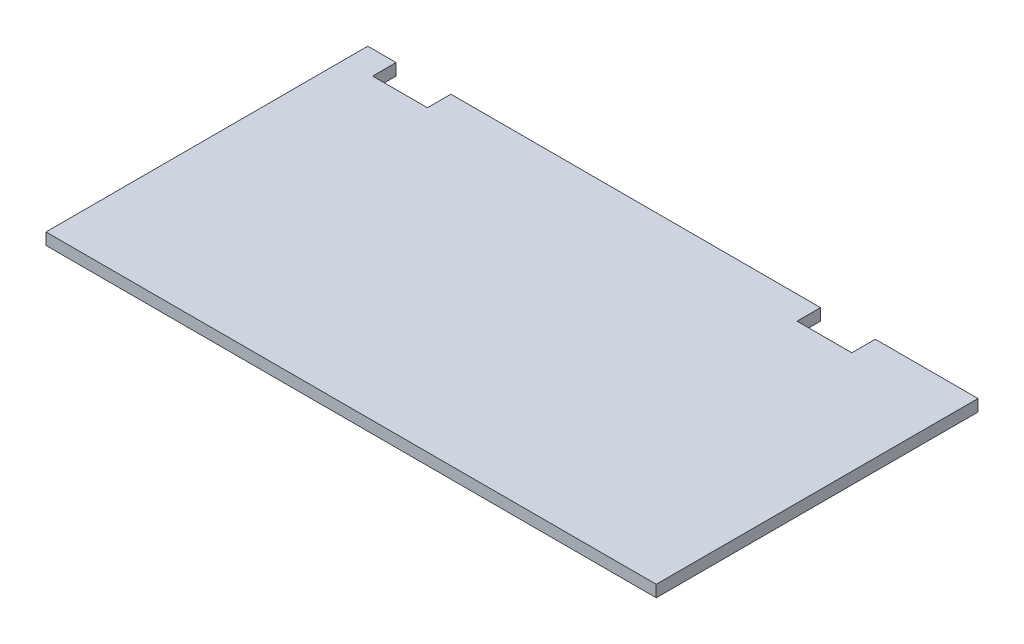
ISO-10303-21;
HEADER;
FILE_DESCRIPTION(('STEP AP214'),'2;1');
FILE_NAME('part.step','',(''),(''),'','','');
FILE_SCHEMA(('AUTOMOTIVE_DESIGN { 1 0 10303 214 1 1 1 1 }'));
ENDSEC;
DATA;
#1=APPLICATION_CONTEXT('core data for automotive mechanical design processes');
#2=APPLICATION_PROTOCOL_DEFINITION('international standard','automotive_design',2000,#1);
#3=PRODUCT_CONTEXT('',#1,'mechanical');
#4=PRODUCT('Part','Part','',(#3));
#5=PRODUCT_RELATED_PRODUCT_CATEGORY('part','',(#4));
#6=PRODUCT_DEFINITION_FORMATION('','',#4);
#7=PRODUCT_DEFINITION_CONTEXT('part definition',#1,'design');
#8=PRODUCT_DEFINITION('design','',#6,#7);
#9=PRODUCT_DEFINITION_SHAPE('','',#8);
#10=(LENGTH_UNIT() NAMED_UNIT(*) SI_UNIT(.MILLI.,.METRE.));
#11=(NAMED_UNIT(*) PLANE_ANGLE_UNIT() SI_UNIT($,.RADIAN.));
#12=(NAMED_UNIT(*) SI_UNIT($,.STERADIAN.) SOLID_ANGLE_UNIT());
#13=UNCERTAINTY_MEASURE_WITH_UNIT(LENGTH_MEASURE(1.E-05),#10,'distance_accuracy_value','');
#14=(GEOMETRIC_REPRESENTATION_CONTEXT(3) GLOBAL_UNCERTAINTY_ASSIGNED_CONTEXT((#13)) GLOBAL_UNIT_ASSIGNED_CONTEXT((#10,
#11,#12)) REPRESENTATION_CONTEXT('',''));
#15=CARTESIAN_POINT('',(0.,0.,0.));
#16=DIRECTION('',(0.,0.,1.));
#17=DIRECTION('',(1.,0.,0.));
#18=AXIS2_PLACEMENT_3D('',#15,#16,#17);
#19=CARTESIAN_POINT('',(0.,19.05,-522.2875));
#20=DIRECTION('',(0.,0.,1.));
#21=DIRECTION('',(1.,0.,0.));
#22=AXIS2_PLACEMENT_3D('',#19,#20,#21);
#23=PLANE('',#22);
#24=DIRECTION('',(-1.,0.,0.));
#25=VECTOR('',#24,1.);
#26=CARTESIAN_POINT('',(0.,0.,-522.2875));
#27=LINE('',#26,#25);
#28=CARTESIAN_POINT('',(990.6,0.,-522.2875));
#29=VERTEX_POINT('',#28);
#30=CARTESIAN_POINT('',(823.912499999996,0.,-522.287500000002));
#31=VERTEX_POINT('',#30);
#32=EDGE_CURVE('E143',#29,#31,#27,.T.);
#33=ORIENTED_EDGE('',*,*,#32,.T.);
#34=DIRECTION('',(0.,1.,0.));
#35=VECTOR('',#34,1.);
#36=CARTESIAN_POINT('',(823.912499999996,0.,-522.287500000002));
#37=LINE('',#36,#35);
#38=CARTESIAN_POINT('',(823.912499999996,19.05,-522.287500000002));
#39=VERTEX_POINT('',#38);
#40=EDGE_CURVE('E127',#31,#39,#37,.T.);
#41=ORIENTED_EDGE('',*,*,#40,.T.);
#42=DIRECTION('',(-1.,0.,0.));
#43=VECTOR('',#42,1.);
#44=CARTESIAN_POINT('',(0.,19.05,-522.2875));
#45=LINE('',#44,#43);
#46=CARTESIAN_POINT('',(990.6,19.05,-522.2875));
#47=VERTEX_POINT('',#46);
#48=EDGE_CURVE('E176',#47,#39,#45,.T.);
#49=ORIENTED_EDGE('',*,*,#48,.F.);
#50=DIRECTION('',(0.,-1.,0.));
#51=VECTOR('',#50,1.);
#52=CARTESIAN_POINT('',(990.6,19.05,-522.2875));
#53=LINE('',#52,#51);
#54=EDGE_CURVE('E150',#47,#29,#53,.T.);
#55=ORIENTED_EDGE('',*,*,#54,.T.);
#56=EDGE_LOOP('',(#33,#41,#49,#55));
#57=FACE_BOUND('',#56,.T.);
#58=ADVANCED_FACE('F38',(#57),#23,.F.);
#59=CARTESIAN_POINT('',(46.0374999999987,19.05,-522.287500000003));
#60=VERTEX_POINT('',#59);
#61=CARTESIAN_POINT('',(0.,19.05,-522.2875));
#62=VERTEX_POINT('',#61);
#63=EDGE_CURVE('E180',#60,#62,#45,.T.);
#64=ORIENTED_EDGE('',*,*,#63,.F.);
#65=DIRECTION('',(0.,1.,0.));
#66=VECTOR('',#65,1.);
#67=CARTESIAN_POINT('',(46.0374999999987,0.,-522.287500000003));
#68=LINE('',#67,#66);
#69=CARTESIAN_POINT('',(46.0374999999987,0.,-522.287500000003));
#70=VERTEX_POINT('',#69);
#71=EDGE_CURVE('E200',#70,#60,#68,.T.);
#72=ORIENTED_EDGE('',*,*,#71,.F.);
#73=CARTESIAN_POINT('',(0.,0.,-522.2875));
#74=VERTEX_POINT('',#73);
#75=EDGE_CURVE('E154',#70,#74,#27,.T.);
#76=ORIENTED_EDGE('',*,*,#75,.T.);
#77=DIRECTION('',(0.,-1.,0.));
#78=VECTOR('',#77,1.);
#79=CARTESIAN_POINT('',(0.,19.05,-522.2875));
#80=LINE('',#79,#78);
#81=EDGE_CURVE('E178',#62,#74,#80,.T.);
#82=ORIENTED_EDGE('',*,*,#81,.F.);
#83=EDGE_LOOP('',(#64,#72,#76,#82));
#84=FACE_BOUND('',#83,.T.);
#85=ADVANCED_FACE('F236',(#84),#23,.F.);
#86=CARTESIAN_POINT('',(0.,19.05,0.));
#87=DIRECTION('',(1.,0.,0.));
#88=DIRECTION('',(0.,0.,-1.));
#89=AXIS2_PLACEMENT_3D('',#86,#87,#88);
#90=PLANE('',#89);
#91=DIRECTION('',(0.,0.,1.));
#92=VECTOR('',#91,1.);
#93=CARTESIAN_POINT('',(0.,0.,0.));
#94=LINE('',#93,#92);
#95=CARTESIAN_POINT('',(0.,0.,0.));
#96=VERTEX_POINT('',#95);
#97=EDGE_CURVE('E170',#74,#96,#94,.T.);
#98=ORIENTED_EDGE('',*,*,#97,.T.);
#99=DIRECTION('',(0.,-1.,0.));
#100=VECTOR('',#99,1.);
#101=CARTESIAN_POINT('',(0.,19.05,0.));
#102=LINE('',#101,#100);
#103=CARTESIAN_POINT('',(0.,19.05,0.));
#104=VERTEX_POINT('',#103);
#105=EDGE_CURVE('E11',#104,#96,#102,.T.);
#106=ORIENTED_EDGE('',*,*,#105,.F.);
#107=DIRECTION('',(0.,0.,1.));
#108=VECTOR('',#107,1.);
#109=CARTESIAN_POINT('',(0.,19.05,0.));
#110=LINE('',#109,#108);
#111=EDGE_CURVE('E151',#62,#104,#110,.T.);
#112=ORIENTED_EDGE('',*,*,#111,.F.);
#113=ORIENTED_EDGE('',*,*,#81,.T.);
#114=EDGE_LOOP('',(#98,#106,#112,#113));
#115=FACE_BOUND('',#114,.T.);
#116=ADVANCED_FACE('F40',(#115),#90,.F.);
#117=CARTESIAN_POINT('',(0.,19.05,0.));
#118=DIRECTION('',(0.,0.,-1.));
#119=DIRECTION('',(-1.,0.,0.));
#120=AXIS2_PLACEMENT_3D('',#117,#118,#119);
#121=PLANE('',#120);
#122=DIRECTION('',(1.,0.,0.));
#123=VECTOR('',#122,1.);
#124=CARTESIAN_POINT('',(0.,0.,0.));
#125=LINE('',#124,#123);
#126=CARTESIAN_POINT('',(990.6,0.,0.));
#127=VERTEX_POINT('',#126);
#128=EDGE_CURVE('E167',#96,#127,#125,.T.);
#129=ORIENTED_EDGE('',*,*,#128,.T.);
#130=DIRECTION('',(0.,-1.,0.));
#131=VECTOR('',#130,1.);
#132=CARTESIAN_POINT('',(990.6,19.05,0.));
#133=LINE('',#132,#131);
#134=CARTESIAN_POINT('',(990.6,19.05,0.));
#135=VERTEX_POINT('',#134);
#136=EDGE_CURVE('E46',#135,#127,#133,.T.);
#137=ORIENTED_EDGE('',*,*,#136,.F.);
#138=DIRECTION('',(1.,0.,0.));
#139=VECTOR('',#138,1.);
#140=CARTESIAN_POINT('',(0.,19.05,0.));
#141=LINE('',#140,#139);
#142=EDGE_CURVE('E156',#104,#135,#141,.T.);
#143=ORIENTED_EDGE('',*,*,#142,.F.);
#144=ORIENTED_EDGE('',*,*,#105,.T.);
#145=EDGE_LOOP('',(#129,#137,#143,#144));
#146=FACE_BOUND('',#145,.T.);
#147=ADVANCED_FACE('F240',(#146),#121,.F.);
#148=CARTESIAN_POINT('',(990.6,19.05,0.));
#149=DIRECTION('',(-1.,0.,0.));
#150=DIRECTION('',(0.,0.,1.));
#151=AXIS2_PLACEMENT_3D('',#148,#149,#150);
#152=PLANE('',#151);
#153=DIRECTION('',(0.,0.,-1.));
#154=VECTOR('',#153,1.);
#155=CARTESIAN_POINT('',(990.6,0.,0.));
#156=LINE('',#155,#154);
#157=EDGE_CURVE('E161',#127,#29,#156,.T.);
#158=ORIENTED_EDGE('',*,*,#157,.T.);
#159=ORIENTED_EDGE('',*,*,#54,.F.);
#160=DIRECTION('',(0.,0.,-1.));
#161=VECTOR('',#160,1.);
#162=CARTESIAN_POINT('',(990.6,19.05,0.));
#163=LINE('',#162,#161);
#164=EDGE_CURVE('E181',#135,#47,#163,.T.);
#165=ORIENTED_EDGE('',*,*,#164,.F.);
#166=ORIENTED_EDGE('',*,*,#136,.T.);
#167=EDGE_LOOP('',(#158,#159,#165,#166));
#168=FACE_BOUND('',#167,.T.);
#169=ADVANCED_FACE('F243',(#168),#152,.F.);
#170=CARTESIAN_POINT('',(735.012499999996,19.05,-522.287500000002));
#171=VERTEX_POINT('',#170);
#172=CARTESIAN_POINT('',(134.937499999998,19.05,-522.287500000003));
#173=VERTEX_POINT('',#172);
#174=EDGE_CURVE('E179',#171,#173,#45,.T.);
#175=ORIENTED_EDGE('',*,*,#174,.F.);
#176=DIRECTION('',(0.,1.,0.));
#177=VECTOR('',#176,1.);
#178=CARTESIAN_POINT('',(735.012499999996,0.,-522.287500000002));
#179=LINE('',#178,#177);
#180=CARTESIAN_POINT('',(735.012499999996,0.,-522.287500000002));
#181=VERTEX_POINT('',#180);
#182=EDGE_CURVE('E137',#181,#171,#179,.T.);
#183=ORIENTED_EDGE('',*,*,#182,.F.);
#184=CARTESIAN_POINT('',(134.937499999998,0.,-522.287500000003));
#185=VERTEX_POINT('',#184);
#186=EDGE_CURVE('E152',#181,#185,#27,.T.);
#187=ORIENTED_EDGE('',*,*,#186,.T.);
#188=DIRECTION('',(0.,1.,0.));
#189=VECTOR('',#188,1.);
#190=CARTESIAN_POINT('',(134.937499999998,0.,-522.287500000003));
#191=LINE('',#190,#189);
#192=EDGE_CURVE('E202',#185,#173,#191,.T.);
#193=ORIENTED_EDGE('',*,*,#192,.T.);
#194=EDGE_LOOP('',(#175,#183,#187,#193));
#195=FACE_BOUND('',#194,.T.);
#196=ADVANCED_FACE('F226',(#195),#23,.F.);
#197=CARTESIAN_POINT('',(0.,19.05,0.));
#198=DIRECTION('',(0.,-1.,0.));
#199=DIRECTION('',(0.,0.,-1.));
#200=AXIS2_PLACEMENT_3D('',#197,#198,#199);
#201=PLANE('',#200);
#202=ORIENTED_EDGE('',*,*,#48,.T.);
#203=DIRECTION('',(0.,0.,-1.));
#204=VECTOR('',#203,1.);
#205=CARTESIAN_POINT('',(823.912499999996,19.05,-484.187500000003));
#206=LINE('',#205,#204);
#207=CARTESIAN_POINT('',(823.912499999996,19.05,-484.187500000003));
#208=VERTEX_POINT('',#207);
#209=EDGE_CURVE('E132',#208,#39,#206,.T.);
#210=ORIENTED_EDGE('',*,*,#209,.F.);
#211=DIRECTION('',(1.,0.,0.));
#212=VECTOR('',#211,1.);
#213=CARTESIAN_POINT('',(823.912499999996,19.05,-484.187500000003));
#214=LINE('',#213,#212);
#215=CARTESIAN_POINT('',(735.012499999996,19.05,-484.187500000003));
#216=VERTEX_POINT('',#215);
#217=EDGE_CURVE('E146',#216,#208,#214,.T.);
#218=ORIENTED_EDGE('',*,*,#217,.F.);
#219=DIRECTION('',(0.,0.,1.));
#220=VECTOR('',#219,1.);
#221=CARTESIAN_POINT('',(735.012499999996,19.05,-484.187500000003));
#222=LINE('',#221,#220);
#223=EDGE_CURVE('E214',#171,#216,#222,.T.);
#224=ORIENTED_EDGE('',*,*,#223,.F.);
#225=ORIENTED_EDGE('',*,*,#174,.T.);
#226=DIRECTION('',(0.,0.,-1.));
#227=VECTOR('',#226,1.);
#228=CARTESIAN_POINT('',(134.937499999998,19.05,-522.287500000003));
#229=LINE('',#228,#227);
#230=CARTESIAN_POINT('',(134.937499999998,19.05,-484.187500000002));
#231=VERTEX_POINT('',#230);
#232=EDGE_CURVE('E187',#231,#173,#229,.T.);
#233=ORIENTED_EDGE('',*,*,#232,.F.);
#234=DIRECTION('',(1.,0.,0.));
#235=VECTOR('',#234,1.);
#236=CARTESIAN_POINT('',(46.0374999999987,19.05,-484.187500000002));
#237=LINE('',#236,#235);
#238=CARTESIAN_POINT('',(46.0374999999987,19.05,-484.187500000002));
#239=VERTEX_POINT('',#238);
#240=EDGE_CURVE('E196',#239,#231,#237,.T.);
#241=ORIENTED_EDGE('',*,*,#240,.F.);
#242=DIRECTION('',(0.,0.,1.));
#243=VECTOR('',#242,1.);
#244=CARTESIAN_POINT('',(46.0374999999987,19.05,-522.287500000003));
#245=LINE('',#244,#243);
#246=EDGE_CURVE('E193',#60,#239,#245,.T.);
#247=ORIENTED_EDGE('',*,*,#246,.F.);
#248=ORIENTED_EDGE('',*,*,#63,.T.);
#249=ORIENTED_EDGE('',*,*,#111,.T.);
#250=ORIENTED_EDGE('',*,*,#142,.T.);
#251=ORIENTED_EDGE('',*,*,#164,.T.);
#252=EDGE_LOOP('',(#202,#210,#218,#224,#225,#233,#241,#247,#248,#249,#250,#251));
#253=FACE_BOUND('',#252,.T.);
#254=ADVANCED_FACE('F232',(#253),#201,.F.);
#255=CARTESIAN_POINT('',(0.,0.,0.));
#256=DIRECTION('',(0.,-1.,0.));
#257=DIRECTION('',(0.,0.,-1.));
#258=AXIS2_PLACEMENT_3D('',#255,#256,#257);
#259=PLANE('',#258);
#260=DIRECTION('',(0.,0.,-1.));
#261=VECTOR('',#260,1.);
#262=CARTESIAN_POINT('',(823.912499999996,0.,-484.187500000003));
#263=LINE('',#262,#261);
#264=CARTESIAN_POINT('',(823.912499999996,0.,-484.187500000003));
#265=VERTEX_POINT('',#264);
#266=EDGE_CURVE('E130',#265,#31,#263,.T.);
#267=ORIENTED_EDGE('',*,*,#266,.T.);
#268=ORIENTED_EDGE('',*,*,#32,.F.);
#269=ORIENTED_EDGE('',*,*,#157,.F.);
#270=ORIENTED_EDGE('',*,*,#128,.F.);
#271=ORIENTED_EDGE('',*,*,#97,.F.);
#272=ORIENTED_EDGE('',*,*,#75,.F.);
#273=DIRECTION('',(0.,0.,1.));
#274=VECTOR('',#273,1.);
#275=CARTESIAN_POINT('',(46.0374999999987,0.,-522.287500000003));
#276=LINE('',#275,#274);
#277=CARTESIAN_POINT('',(46.0374999999987,0.,-484.187500000002));
#278=VERTEX_POINT('',#277);
#279=EDGE_CURVE('E184',#70,#278,#276,.T.);
#280=ORIENTED_EDGE('',*,*,#279,.T.);
#281=DIRECTION('',(1.,0.,0.));
#282=VECTOR('',#281,1.);
#283=CARTESIAN_POINT('',(46.0374999999987,0.,-484.187500000002));
#284=LINE('',#283,#282);
#285=CARTESIAN_POINT('',(134.937499999998,0.,-484.187500000002));
#286=VERTEX_POINT('',#285);
#287=EDGE_CURVE('E188',#278,#286,#284,.T.);
#288=ORIENTED_EDGE('',*,*,#287,.T.);
#289=DIRECTION('',(0.,0.,-1.));
#290=VECTOR('',#289,1.);
#291=CARTESIAN_POINT('',(134.937499999998,0.,-522.287500000003));
#292=LINE('',#291,#290);
#293=EDGE_CURVE('E61',#286,#185,#292,.T.);
#294=ORIENTED_EDGE('',*,*,#293,.T.);
#295=ORIENTED_EDGE('',*,*,#186,.F.);
#296=DIRECTION('',(0.,0.,1.));
#297=VECTOR('',#296,1.);
#298=CARTESIAN_POINT('',(735.012499999996,0.,-484.187500000003));
#299=LINE('',#298,#297);
#300=CARTESIAN_POINT('',(735.012499999996,0.,-484.187500000003));
#301=VERTEX_POINT('',#300);
#302=EDGE_CURVE('E145',#181,#301,#299,.T.);
#303=ORIENTED_EDGE('',*,*,#302,.T.);
#304=DIRECTION('',(1.,0.,0.));
#305=VECTOR('',#304,1.);
#306=CARTESIAN_POINT('',(823.912499999996,0.,-484.187500000003));
#307=LINE('',#306,#305);
#308=EDGE_CURVE('E53',#301,#265,#307,.T.);
#309=ORIENTED_EDGE('',*,*,#308,.T.);
#310=EDGE_LOOP('',(#267,#268,#269,#270,#271,#272,#280,#288,#294,#295,#303,#309));
#311=FACE_BOUND('',#310,.T.);
#312=ADVANCED_FACE('F141',(#311),#259,.T.);
#313=CARTESIAN_POINT('',(46.0374999999987,0.,-522.287500000003));
#314=DIRECTION('',(-1.,0.,0.));
#315=DIRECTION('',(0.,0.,1.));
#316=AXIS2_PLACEMENT_3D('',#313,#314,#315);
#317=PLANE('',#316);
#318=ORIENTED_EDGE('',*,*,#246,.T.);
#319=DIRECTION('',(0.,1.,0.));
#320=VECTOR('',#319,1.);
#321=CARTESIAN_POINT('',(46.0374999999987,0.,-484.187500000002));
#322=LINE('',#321,#320);
#323=EDGE_CURVE('E192',#278,#239,#322,.T.);
#324=ORIENTED_EDGE('',*,*,#323,.F.);
#325=ORIENTED_EDGE('',*,*,#279,.F.);
#326=ORIENTED_EDGE('',*,*,#71,.T.);
#327=EDGE_LOOP('',(#318,#324,#325,#326));
#328=FACE_BOUND('',#327,.T.);
#329=ADVANCED_FACE('F247',(#328),#317,.F.);
#330=CARTESIAN_POINT('',(134.937499999998,0.,-522.287500000003));
#331=DIRECTION('',(1.,0.,0.));
#332=DIRECTION('',(0.,0.,-1.));
#333=AXIS2_PLACEMENT_3D('',#330,#331,#332);
#334=PLANE('',#333);
#335=ORIENTED_EDGE('',*,*,#232,.T.);
#336=ORIENTED_EDGE('',*,*,#192,.F.);
#337=ORIENTED_EDGE('',*,*,#293,.F.);
#338=DIRECTION('',(0.,1.,0.));
#339=VECTOR('',#338,1.);
#340=CARTESIAN_POINT('',(134.937499999998,0.,-484.187500000002));
#341=LINE('',#340,#339);
#342=EDGE_CURVE('E205',#286,#231,#341,.T.);
#343=ORIENTED_EDGE('',*,*,#342,.T.);
#344=EDGE_LOOP('',(#335,#336,#337,#343));
#345=FACE_BOUND('',#344,.T.);
#346=ADVANCED_FACE('F250',(#345),#334,.F.);
#347=CARTESIAN_POINT('',(46.0374999999987,0.,-484.187500000002));
#348=DIRECTION('',(0.,0.,1.));
#349=DIRECTION('',(1.,0.,0.));
#350=AXIS2_PLACEMENT_3D('',#347,#348,#349);
#351=PLANE('',#350);
#352=ORIENTED_EDGE('',*,*,#240,.T.);
#353=ORIENTED_EDGE('',*,*,#342,.F.);
#354=ORIENTED_EDGE('',*,*,#287,.F.);
#355=ORIENTED_EDGE('',*,*,#323,.T.);
#356=EDGE_LOOP('',(#352,#353,#354,#355));
#357=FACE_BOUND('',#356,.T.);
#358=ADVANCED_FACE('F249',(#357),#351,.F.);
#359=CARTESIAN_POINT('',(823.912499999996,0.,-484.187500000003));
#360=DIRECTION('',(1.,0.,0.));
#361=DIRECTION('',(0.,0.,-1.));
#362=AXIS2_PLACEMENT_3D('',#359,#360,#361);
#363=PLANE('',#362);
#364=ORIENTED_EDGE('',*,*,#209,.T.);
#365=ORIENTED_EDGE('',*,*,#40,.F.);
#366=ORIENTED_EDGE('',*,*,#266,.F.);
#367=DIRECTION('',(0.,1.,0.));
#368=VECTOR('',#367,1.);
#369=CARTESIAN_POINT('',(823.912499999996,0.,-484.187500000003));
#370=LINE('',#369,#368);
#371=EDGE_CURVE('E175',#265,#208,#370,.T.);
#372=ORIENTED_EDGE('',*,*,#371,.T.);
#373=EDGE_LOOP('',(#364,#365,#366,#372));
#374=FACE_BOUND('',#373,.T.);
#375=ADVANCED_FACE('F129',(#374),#363,.F.);
#376=CARTESIAN_POINT('',(823.912499999996,0.,-484.187500000003));
#377=DIRECTION('',(0.,0.,1.));
#378=DIRECTION('',(1.,0.,0.));
#379=AXIS2_PLACEMENT_3D('',#376,#377,#378);
#380=PLANE('',#379);
#381=ORIENTED_EDGE('',*,*,#217,.T.);
#382=ORIENTED_EDGE('',*,*,#371,.F.);
#383=ORIENTED_EDGE('',*,*,#308,.F.);
#384=DIRECTION('',(0.,1.,0.));
#385=VECTOR('',#384,1.);
#386=CARTESIAN_POINT('',(735.012499999996,0.,-484.187500000003));
#387=LINE('',#386,#385);
#388=EDGE_CURVE('E209',#301,#216,#387,.T.);
#389=ORIENTED_EDGE('',*,*,#388,.T.);
#390=EDGE_LOOP('',(#381,#382,#383,#389));
#391=FACE_BOUND('',#390,.T.);
#392=ADVANCED_FACE('F340',(#391),#380,.F.);
#393=CARTESIAN_POINT('',(735.012499999996,0.,-484.187500000003));
#394=DIRECTION('',(-1.,0.,0.));
#395=DIRECTION('',(0.,0.,1.));
#396=AXIS2_PLACEMENT_3D('',#393,#394,#395);
#397=PLANE('',#396);
#398=ORIENTED_EDGE('',*,*,#223,.T.);
#399=ORIENTED_EDGE('',*,*,#388,.F.);
#400=ORIENTED_EDGE('',*,*,#302,.F.);
#401=ORIENTED_EDGE('',*,*,#182,.T.);
#402=EDGE_LOOP('',(#398,#399,#400,#401));
#403=FACE_BOUND('',#402,.T.);
#404=ADVANCED_FACE('F222',(#403),#397,.F.);
#405=CLOSED_SHELL('',(#58,#85,#116,#147,#169,#196,#254,#312,#329,#346,#358,#375,#392,#404));
#406=MANIFOLD_SOLID_BREP('B2',#405);
#407=ADVANCED_BREP_SHAPE_REPRESENTATION('',(#18,#406),#14);
#408=SHAPE_DEFINITION_REPRESENTATION(#9,#407);
ENDSEC;
END-ISO-10303-21;
